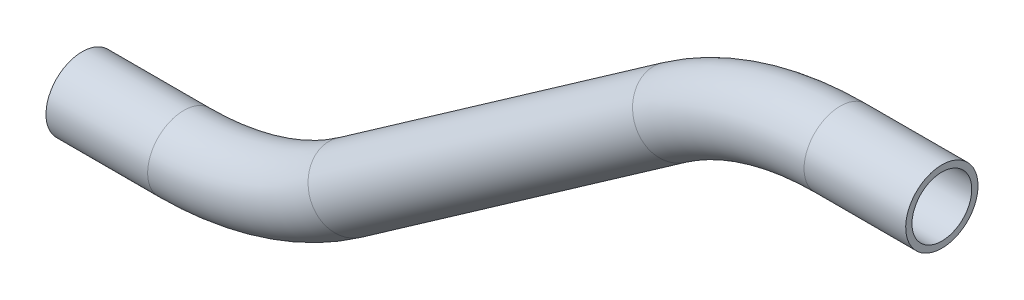
ISO-10303-21;
HEADER;
FILE_DESCRIPTION(('STEP AP214'),'2;1');
FILE_NAME('part.step','',(''),(''),'','','');
FILE_SCHEMA(('AUTOMOTIVE_DESIGN { 1 0 10303 214 1 1 1 1 }'));
ENDSEC;
DATA;
#1=APPLICATION_CONTEXT('core data for automotive mechanical design processes');
#2=APPLICATION_PROTOCOL_DEFINITION('international standard','automotive_design',2000,#1);
#3=PRODUCT_CONTEXT('',#1,'mechanical');
#4=PRODUCT('Part','Part','',(#3));
#5=PRODUCT_RELATED_PRODUCT_CATEGORY('part','',(#4));
#6=PRODUCT_DEFINITION_FORMATION('','',#4);
#7=PRODUCT_DEFINITION_CONTEXT('part definition',#1,'design');
#8=PRODUCT_DEFINITION('design','',#6,#7);
#9=PRODUCT_DEFINITION_SHAPE('','',#8);
#10=(LENGTH_UNIT() NAMED_UNIT(*) SI_UNIT(.MILLI.,.METRE.));
#11=(NAMED_UNIT(*) PLANE_ANGLE_UNIT() SI_UNIT($,.RADIAN.));
#12=(NAMED_UNIT(*) SI_UNIT($,.STERADIAN.) SOLID_ANGLE_UNIT());
#13=UNCERTAINTY_MEASURE_WITH_UNIT(LENGTH_MEASURE(1.E-05),#10,'distance_accuracy_value','');
#14=(GEOMETRIC_REPRESENTATION_CONTEXT(3) GLOBAL_UNCERTAINTY_ASSIGNED_CONTEXT((#13)) GLOBAL_UNIT_ASSIGNED_CONTEXT((#10,
#11,#12)) REPRESENTATION_CONTEXT('',''));
#15=CARTESIAN_POINT('',(0.,0.,0.));
#16=DIRECTION('',(0.,0.,1.));
#17=DIRECTION('',(1.,0.,0.));
#18=AXIS2_PLACEMENT_3D('',#15,#16,#17);
#19=CARTESIAN_POINT('',(121.865926636058,47.4325265861424,0.));
#20=DIRECTION('',(-1.,0.,0.));
#21=DIRECTION('',(0.,-1.,0.));
#22=AXIS2_PLACEMENT_3D('',#19,#20,#21);
#23=CYLINDRICAL_SURFACE('',#22,9.525);
#24=CARTESIAN_POINT('',(95.0916943486364,47.4325265861424,0.));
#25=DIRECTION('',(-1.,0.,0.));
#26=DIRECTION('',(0.,-1.,0.));
#27=AXIS2_PLACEMENT_3D('',#24,#25,#26);
#28=CIRCLE('',#27,9.525);
#29=CARTESIAN_POINT('',(95.0916943486364,56.9575265861425,0.));
#30=VERTEX_POINT('',#29);
#31=EDGE_CURVE('E56',#30,#30,#28,.T.);
#32=ORIENTED_EDGE('',*,*,#31,.F.);
#33=EDGE_LOOP('',(#32));
#34=FACE_BOUND('',#33,.T.);
#35=CARTESIAN_POINT('',(121.865926636058,47.4325265861424,0.));
#36=DIRECTION('',(-1.,0.,0.));
#37=DIRECTION('',(0.,-1.,0.));
#38=AXIS2_PLACEMENT_3D('',#35,#36,#37);
#39=CIRCLE('',#38,9.525);
#40=CARTESIAN_POINT('',(121.865926636058,37.9075265861424,0.));
#41=VERTEX_POINT('',#40);
#42=EDGE_CURVE('E53',#41,#41,#39,.T.);
#43=ORIENTED_EDGE('',*,*,#42,.T.);
#44=EDGE_LOOP('',(#43));
#45=FACE_BOUND('',#44,.T.);
#46=ADVANCED_FACE('F32',(#34,#45),#23,.T.);
#47=CARTESIAN_POINT('',(95.0916943486364,-28.7674734138575,0.));
#48=DIRECTION('',(0.,0.,1.));
#49=DIRECTION('',(1.,0.,0.));
#50=AXIS2_PLACEMENT_3D('',#47,#48,#49);
#51=TOROIDAL_SURFACE('',#50,76.2,9.525);
#52=CARTESIAN_POINT('',(51.3851698986866,33.6519123609635,0.));
#53=DIRECTION('',(-0.819152044288991,-0.573576436351047,0.));
#54=DIRECTION('',(0.573576436351047,-0.819152044288991,0.));
#55=AXIS2_PLACEMENT_3D('',#52,#53,#54);
#56=CIRCLE('',#55,9.525);
#57=CARTESIAN_POINT('',(45.9218543424428,41.4543355828162,0.));
#58=VERTEX_POINT('',#57);
#59=EDGE_CURVE('E59',#58,#58,#56,.T.);
#60=CARTESIAN_POINT('',(95.0916943486364,-28.7674734138575,0.));
#61=DIRECTION('',(0.,0.,1.));
#62=DIRECTION('',(1.,0.,0.));
#63=AXIS2_PLACEMENT_3D('',#60,#61,#62);
#64=CIRCLE('',#63,85.725);
#65=EDGE_CURVE('',#30,#58,#64,.T.);
#66=ORIENTED_EDGE('',*,*,#31,.T.);
#67=ORIENTED_EDGE('',*,*,#59,.F.);
#68=ORIENTED_EDGE('',*,*,#65,.T.);
#69=ORIENTED_EDGE('',*,*,#65,.F.);
#70=EDGE_LOOP('',(#66,#68,#67,#69));
#71=FACE_BOUND('',#70,.T.);
#72=ADVANCED_FACE('F78',(#71),#51,.T.);
#73=CARTESIAN_POINT('',(51.3851698986866,33.6519123609635,0.));
#74=DIRECTION('',(-0.819152044288991,-0.573576436351048,0.));
#75=DIRECTION('',(0.573576436351048,-0.819152044288991,0.));
#76=AXIS2_PLACEMENT_3D('',#73,#74,#75);
#77=CYLINDRICAL_SURFACE('',#76,9.525);
#78=CARTESIAN_POINT('',(-34.0920881762132,-26.1999080885784,0.));
#79=DIRECTION('',(-0.819152044288991,-0.573576436351047,0.));
#80=DIRECTION('',(0.573576436351047,-0.819152044288991,0.));
#81=AXIS2_PLACEMENT_3D('',#78,#79,#80);
#82=CIRCLE('',#81,9.525);
#83=CARTESIAN_POINT('',(-28.6287726199695,-34.002331310431,0.));
#84=VERTEX_POINT('',#83);
#85=EDGE_CURVE('E61',#84,#84,#82,.T.);
#86=ORIENTED_EDGE('',*,*,#85,.F.);
#87=EDGE_LOOP('',(#86));
#88=FACE_BOUND('',#87,.T.);
#89=ORIENTED_EDGE('',*,*,#59,.T.);
#90=EDGE_LOOP('',(#89));
#91=FACE_BOUND('',#90,.T.);
#92=ADVANCED_FACE('F71',(#88,#91),#77,.T.);
#93=CARTESIAN_POINT('',(-77.7986126261631,36.2194776862428,0.));
#94=DIRECTION('',(0.,0.,-1.));
#95=DIRECTION('',(-1.,0.,0.));
#96=AXIS2_PLACEMENT_3D('',#93,#94,#95);
#97=TOROIDAL_SURFACE('',#96,76.2,9.525);
#98=CARTESIAN_POINT('',(-77.7986126261629,-39.9805223137574,0.));
#99=DIRECTION('',(-1.,0.,0.));
#100=DIRECTION('',(0.,-1.,0.));
#101=AXIS2_PLACEMENT_3D('',#98,#99,#100);
#102=CIRCLE('',#101,9.525);
#103=CARTESIAN_POINT('',(-77.7986126261629,-49.5055223137572,0.));
#104=VERTEX_POINT('',#103);
#105=EDGE_CURVE('E36',#104,#104,#102,.T.);
#106=CARTESIAN_POINT('',(-77.7986126261631,36.2194776862428,0.));
#107=DIRECTION('',(0.,0.,-1.));
#108=DIRECTION('',(-1.,0.,0.));
#109=AXIS2_PLACEMENT_3D('',#106,#107,#108);
#110=CIRCLE('',#109,85.725);
#111=EDGE_CURVE('',#84,#104,#110,.T.);
#112=ORIENTED_EDGE('',*,*,#85,.T.);
#113=ORIENTED_EDGE('',*,*,#105,.F.);
#114=ORIENTED_EDGE('',*,*,#111,.T.);
#115=ORIENTED_EDGE('',*,*,#111,.F.);
#116=EDGE_LOOP('',(#112,#114,#113,#115));
#117=FACE_BOUND('',#116,.T.);
#118=ADVANCED_FACE('F69',(#117),#97,.T.);
#119=CARTESIAN_POINT('',(-77.7986126261629,-39.9805223137574,0.));
#120=DIRECTION('',(-1.,0.,0.));
#121=DIRECTION('',(0.,-1.,0.));
#122=AXIS2_PLACEMENT_3D('',#119,#120,#121);
#123=CYLINDRICAL_SURFACE('',#122,9.525);
#124=CARTESIAN_POINT('',(-104.572844913584,-39.9805223137574,0.));
#125=DIRECTION('',(-1.,0.,0.));
#126=DIRECTION('',(0.,-1.,0.));
#127=AXIS2_PLACEMENT_3D('',#124,#125,#126);
#128=CIRCLE('',#127,9.525);
#129=CARTESIAN_POINT('',(-104.572844913584,-49.5055223137574,0.));
#130=VERTEX_POINT('',#129);
#131=EDGE_CURVE('E49',#130,#130,#128,.T.);
#132=ORIENTED_EDGE('',*,*,#131,.F.);
#133=EDGE_LOOP('',(#132));
#134=FACE_BOUND('',#133,.T.);
#135=ORIENTED_EDGE('',*,*,#105,.T.);
#136=EDGE_LOOP('',(#135));
#137=FACE_BOUND('',#136,.T.);
#138=ADVANCED_FACE('F34',(#134,#137),#123,.T.);
#139=CARTESIAN_POINT('',(121.865926636058,47.4325265861424,0.));
#140=DIRECTION('',(-1.,0.,0.));
#141=DIRECTION('',(0.,-1.,0.));
#142=AXIS2_PLACEMENT_3D('',#139,#140,#141);
#143=PLANE('',#142);
#144=CARTESIAN_POINT('',(121.865926636058,47.4325265861424,0.));
#145=DIRECTION('',(-1.,0.,0.));
#146=DIRECTION('',(0.,-1.,0.));
#147=AXIS2_PLACEMENT_3D('',#144,#145,#146);
#148=CIRCLE('',#147,7.874);
#149=CARTESIAN_POINT('',(121.865926636058,39.5585265861424,0.));
#150=VERTEX_POINT('',#149);
#151=EDGE_CURVE('E52',#150,#150,#148,.F.);
#152=ORIENTED_EDGE('',*,*,#151,.F.);
#153=EDGE_LOOP('',(#152));
#154=FACE_BOUND('',#153,.T.);
#155=ORIENTED_EDGE('',*,*,#42,.F.);
#156=EDGE_LOOP('',(#155));
#157=FACE_BOUND('',#156,.T.);
#158=ADVANCED_FACE('F76',(#154,#157),#143,.F.);
#159=CARTESIAN_POINT('',(-104.572844913584,-39.9805223137574,0.));
#160=DIRECTION('',(-1.,0.,0.));
#161=DIRECTION('',(0.,-1.,0.));
#162=AXIS2_PLACEMENT_3D('',#159,#160,#161);
#163=PLANE('',#162);
#164=CARTESIAN_POINT('',(-104.572844913584,-39.9805223137574,0.));
#165=DIRECTION('',(-1.,0.,0.));
#166=DIRECTION('',(0.,-1.,0.));
#167=AXIS2_PLACEMENT_3D('',#164,#165,#166);
#168=CIRCLE('',#167,7.874);
#169=CARTESIAN_POINT('',(-104.572844913584,-47.8545223137574,0.));
#170=VERTEX_POINT('',#169);
#171=EDGE_CURVE('E10',#170,#170,#168,.F.);
#172=ORIENTED_EDGE('',*,*,#171,.T.);
#173=EDGE_LOOP('',(#172));
#174=FACE_BOUND('',#173,.T.);
#175=ORIENTED_EDGE('',*,*,#131,.T.);
#176=EDGE_LOOP('',(#175));
#177=FACE_BOUND('',#176,.T.);
#178=ADVANCED_FACE('F95',(#174,#177),#163,.T.);
#179=CARTESIAN_POINT('',(121.865926636058,47.4325265861424,0.));
#180=DIRECTION('',(-1.,0.,0.));
#181=DIRECTION('',(0.,-1.,0.));
#182=AXIS2_PLACEMENT_3D('',#179,#180,#181);
#183=CYLINDRICAL_SURFACE('',#182,7.874);
#184=CARTESIAN_POINT('',(95.0916943486364,47.4325265861424,0.));
#185=DIRECTION('',(-1.,0.,0.));
#186=DIRECTION('',(0.,-1.,0.));
#187=AXIS2_PLACEMENT_3D('',#184,#185,#186);
#188=CIRCLE('',#187,7.874);
#189=CARTESIAN_POINT('',(95.0916943486364,55.3065265861425,0.));
#190=VERTEX_POINT('',#189);
#191=EDGE_CURVE('E191',#190,#190,#188,.F.);
#192=ORIENTED_EDGE('',*,*,#191,.F.);
#193=EDGE_LOOP('',(#192));
#194=FACE_BOUND('',#193,.T.);
#195=ORIENTED_EDGE('',*,*,#151,.T.);
#196=EDGE_LOOP('',(#195));
#197=FACE_BOUND('',#196,.T.);
#198=ADVANCED_FACE('F98',(#194,#197),#183,.F.);
#199=CARTESIAN_POINT('',(95.0916943486364,-28.7674734138575,0.));
#200=DIRECTION('',(0.,0.,1.));
#201=DIRECTION('',(1.,0.,0.));
#202=AXIS2_PLACEMENT_3D('',#199,#200,#201);
#203=TOROIDAL_SURFACE('',#202,76.2,7.874);
#204=CARTESIAN_POINT('',(51.3851698986866,33.6519123609635,0.));
#205=DIRECTION('',(-0.819152044288991,-0.573576436351047,0.));
#206=DIRECTION('',(0.573576436351047,-0.819152044288991,0.));
#207=AXIS2_PLACEMENT_3D('',#204,#205,#206);
#208=CIRCLE('',#207,7.874);
#209=CARTESIAN_POINT('',(46.8688290388584,40.1019155576951,0.));
#210=VERTEX_POINT('',#209);
#211=EDGE_CURVE('E190',#210,#210,#208,.F.);
#212=CARTESIAN_POINT('',(95.0916943486364,-28.7674734138575,0.));
#213=DIRECTION('',(0.,0.,1.));
#214=DIRECTION('',(1.,0.,0.));
#215=AXIS2_PLACEMENT_3D('',#212,#213,#214);
#216=CIRCLE('',#215,84.074);
#217=EDGE_CURVE('',#190,#210,#216,.T.);
#218=ORIENTED_EDGE('',*,*,#191,.T.);
#219=ORIENTED_EDGE('',*,*,#211,.F.);
#220=ORIENTED_EDGE('',*,*,#217,.T.);
#221=ORIENTED_EDGE('',*,*,#217,.F.);
#222=EDGE_LOOP('',(#218,#220,#219,#221));
#223=FACE_BOUND('',#222,.T.);
#224=ADVANCED_FACE('F153',(#223),#203,.F.);
#225=CARTESIAN_POINT('',(51.3851698986866,33.6519123609635,0.));
#226=DIRECTION('',(-0.819152044288991,-0.573576436351048,0.));
#227=DIRECTION('',(0.573576436351048,-0.819152044288991,0.));
#228=AXIS2_PLACEMENT_3D('',#225,#226,#227);
#229=CYLINDRICAL_SURFACE('',#228,7.874);
#230=CARTESIAN_POINT('',(-34.0920881762132,-26.1999080885784,0.));
#231=DIRECTION('',(-0.819152044288991,-0.573576436351047,0.));
#232=DIRECTION('',(0.573576436351047,-0.819152044288991,0.));
#233=AXIS2_PLACEMENT_3D('',#230,#231,#232);
#234=CIRCLE('',#233,7.874);
#235=CARTESIAN_POINT('',(-29.5757473163851,-32.6499112853098,0.));
#236=VERTEX_POINT('',#235);
#237=EDGE_CURVE('E45',#236,#236,#234,.F.);
#238=ORIENTED_EDGE('',*,*,#237,.F.);
#239=EDGE_LOOP('',(#238));
#240=FACE_BOUND('',#239,.T.);
#241=ORIENTED_EDGE('',*,*,#211,.T.);
#242=EDGE_LOOP('',(#241));
#243=FACE_BOUND('',#242,.T.);
#244=ADVANCED_FACE('F89',(#240,#243),#229,.F.);
#245=CARTESIAN_POINT('',(-77.7986126261631,36.2194776862428,0.));
#246=DIRECTION('',(0.,0.,-1.));
#247=DIRECTION('',(-1.,0.,0.));
#248=AXIS2_PLACEMENT_3D('',#245,#246,#247);
#249=TOROIDAL_SURFACE('',#248,76.2,7.874);
#250=CARTESIAN_POINT('',(-77.7986126261629,-39.9805223137574,0.));
#251=DIRECTION('',(-1.,0.,0.));
#252=DIRECTION('',(0.,-1.,0.));
#253=AXIS2_PLACEMENT_3D('',#250,#251,#252);
#254=CIRCLE('',#253,7.874);
#255=CARTESIAN_POINT('',(-77.7986126261629,-47.8545223137572,0.));
#256=VERTEX_POINT('',#255);
#257=EDGE_CURVE('E40',#256,#256,#254,.F.);
#258=CARTESIAN_POINT('',(-77.7986126261631,36.2194776862428,0.));
#259=DIRECTION('',(0.,0.,-1.));
#260=DIRECTION('',(-1.,0.,0.));
#261=AXIS2_PLACEMENT_3D('',#258,#259,#260);
#262=CIRCLE('',#261,84.074);
#263=EDGE_CURVE('',#236,#256,#262,.T.);
#264=ORIENTED_EDGE('',*,*,#237,.T.);
#265=ORIENTED_EDGE('',*,*,#257,.F.);
#266=ORIENTED_EDGE('',*,*,#263,.T.);
#267=ORIENTED_EDGE('',*,*,#263,.F.);
#268=EDGE_LOOP('',(#264,#266,#265,#267));
#269=FACE_BOUND('',#268,.T.);
#270=ADVANCED_FACE('F83',(#269),#249,.F.);
#271=CARTESIAN_POINT('',(-77.7986126261629,-39.9805223137574,0.));
#272=DIRECTION('',(-1.,0.,0.));
#273=DIRECTION('',(0.,-1.,0.));
#274=AXIS2_PLACEMENT_3D('',#271,#272,#273);
#275=CYLINDRICAL_SURFACE('',#274,7.874);
#276=ORIENTED_EDGE('',*,*,#171,.F.);
#277=EDGE_LOOP('',(#276));
#278=FACE_BOUND('',#277,.T.);
#279=ORIENTED_EDGE('',*,*,#257,.T.);
#280=EDGE_LOOP('',(#279));
#281=FACE_BOUND('',#280,.T.);
#282=ADVANCED_FACE('F81',(#278,#281),#275,.F.);
#283=CLOSED_SHELL('',(#46,#72,#92,#118,#138,#158,#178,#198,#224,#244,#270,#282));
#284=MANIFOLD_SOLID_BREP('B2',#283);
#285=ADVANCED_BREP_SHAPE_REPRESENTATION('',(#18,#284),#14);
#286=SHAPE_DEFINITION_REPRESENTATION(#9,#285);
ENDSEC;
END-ISO-10303-21;
